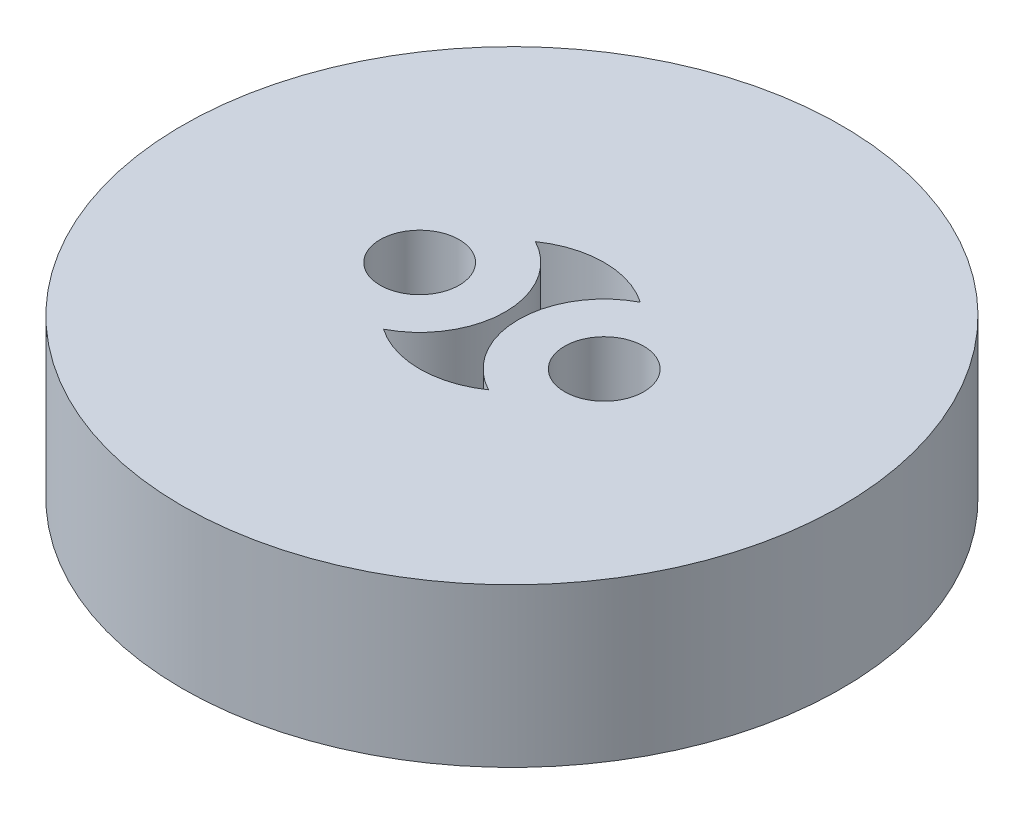
ISO-10303-21;
HEADER;
FILE_DESCRIPTION(('STEP AP214'),'2;1');
FILE_NAME('part.step','',(''),(''),'','','');
FILE_SCHEMA(('AUTOMOTIVE_DESIGN { 1 0 10303 214 1 1 1 1 }'));
ENDSEC;
DATA;
#1=APPLICATION_CONTEXT('core data for automotive mechanical design processes');
#2=APPLICATION_PROTOCOL_DEFINITION('international standard','automotive_design',2000,#1);
#3=PRODUCT_CONTEXT('',#1,'mechanical');
#4=PRODUCT('Part','Part','',(#3));
#5=PRODUCT_RELATED_PRODUCT_CATEGORY('part','',(#4));
#6=PRODUCT_DEFINITION_FORMATION('','',#4);
#7=PRODUCT_DEFINITION_CONTEXT('part definition',#1,'design');
#8=PRODUCT_DEFINITION('design','',#6,#7);
#9=PRODUCT_DEFINITION_SHAPE('','',#8);
#10=(LENGTH_UNIT() NAMED_UNIT(*) SI_UNIT(.MILLI.,.METRE.));
#11=(NAMED_UNIT(*) PLANE_ANGLE_UNIT() SI_UNIT($,.RADIAN.));
#12=(NAMED_UNIT(*) SI_UNIT($,.STERADIAN.) SOLID_ANGLE_UNIT());
#13=UNCERTAINTY_MEASURE_WITH_UNIT(LENGTH_MEASURE(1.E-05),#10,'distance_accuracy_value','');
#14=(GEOMETRIC_REPRESENTATION_CONTEXT(3) GLOBAL_UNCERTAINTY_ASSIGNED_CONTEXT((#13)) GLOBAL_UNIT_ASSIGNED_CONTEXT((#10,
#11,#12)) REPRESENTATION_CONTEXT('',''));
#15=CARTESIAN_POINT('',(0.,0.,0.));
#16=DIRECTION('',(0.,0.,1.));
#17=DIRECTION('',(1.,0.,0.));
#18=AXIS2_PLACEMENT_3D('',#15,#16,#17);
#19=CARTESIAN_POINT('',(0.,6.,0.));
#20=DIRECTION('',(0.,1.,0.));
#21=DIRECTION('',(0.,0.,1.));
#22=AXIS2_PLACEMENT_3D('',#19,#20,#21);
#23=PLANE('',#22);
#24=CARTESIAN_POINT('',(-3.5,6.,0.));
#25=DIRECTION('',(0.,1.,0.));
#26=DIRECTION('',(0.,0.,1.));
#27=AXIS2_PLACEMENT_3D('',#24,#25,#26);
#28=CIRCLE('',#27,1.5);
#29=CARTESIAN_POINT('',(-3.5,6.,1.5));
#30=VERTEX_POINT('',#29);
#31=EDGE_CURVE('E116',#30,#30,#28,.T.);
#32=ORIENTED_EDGE('',*,*,#31,.F.);
#33=EDGE_LOOP('',(#32));
#34=FACE_BOUND('',#33,.T.);
#35=CARTESIAN_POINT('',(0.,6.,0.));
#36=DIRECTION('',(0.,1.,0.));
#37=DIRECTION('',(0.,0.,1.));
#38=AXIS2_PLACEMENT_3D('',#35,#36,#37);
#39=CIRCLE('',#38,12.5);
#40=CARTESIAN_POINT('',(0.,6.,12.5));
#41=VERTEX_POINT('',#40);
#42=EDGE_CURVE('E11',#41,#41,#39,.T.);
#43=ORIENTED_EDGE('',*,*,#42,.T.);
#44=EDGE_LOOP('',(#43));
#45=FACE_BOUND('',#44,.T.);
#46=CARTESIAN_POINT('',(3.5,6.,0.));
#47=DIRECTION('',(0.,1.,0.));
#48=DIRECTION('',(0.,0.,1.));
#49=AXIS2_PLACEMENT_3D('',#46,#47,#48);
#50=CIRCLE('',#49,1.5);
#51=CARTESIAN_POINT('',(3.5,6.,1.5));
#52=VERTEX_POINT('',#51);
#53=EDGE_CURVE('E110',#52,#52,#50,.T.);
#54=ORIENTED_EDGE('',*,*,#53,.F.);
#55=EDGE_LOOP('',(#54));
#56=FACE_BOUND('',#55,.T.);
#57=CARTESIAN_POINT('',(-3.5,6.,0.));
#58=DIRECTION('',(0.,-1.,0.));
#59=DIRECTION('',(0.,0.,1.));
#60=AXIS2_PLACEMENT_3D('',#57,#58,#59);
#61=CIRCLE('',#60,3.25);
#62=CARTESIAN_POINT('',(-1.99107142857143,6.,-2.87847782105865));
#63=VERTEX_POINT('',#62);
#64=CARTESIAN_POINT('',(-1.99107142857143,6.,2.87847782105865));
#65=VERTEX_POINT('',#64);
#66=EDGE_CURVE('E82',#63,#65,#61,.T.);
#67=ORIENTED_EDGE('',*,*,#66,.F.);
#68=CARTESIAN_POINT('',(0.,6.,0.));
#69=DIRECTION('',(0.,1.,0.));
#70=DIRECTION('',(0.,0.,1.));
#71=AXIS2_PLACEMENT_3D('',#68,#69,#70);
#72=CIRCLE('',#71,3.5);
#73=CARTESIAN_POINT('',(1.99107142857143,6.,-2.87847782105865));
#74=VERTEX_POINT('',#73);
#75=EDGE_CURVE('E74',#74,#63,#72,.T.);
#76=ORIENTED_EDGE('',*,*,#75,.F.);
#77=CARTESIAN_POINT('',(3.5,6.,0.));
#78=DIRECTION('',(0.,-1.,0.));
#79=DIRECTION('',(0.,0.,1.));
#80=AXIS2_PLACEMENT_3D('',#77,#78,#79);
#81=CIRCLE('',#80,3.25);
#82=CARTESIAN_POINT('',(1.99107142857143,6.,2.87847782105865));
#83=VERTEX_POINT('',#82);
#84=EDGE_CURVE('E96',#83,#74,#81,.T.);
#85=ORIENTED_EDGE('',*,*,#84,.F.);
#86=CARTESIAN_POINT('',(0.,6.,0.));
#87=DIRECTION('',(0.,1.,0.));
#88=DIRECTION('',(0.,0.,1.));
#89=AXIS2_PLACEMENT_3D('',#86,#87,#88);
#90=CIRCLE('',#89,3.5);
#91=EDGE_CURVE('E94',#65,#83,#90,.T.);
#92=ORIENTED_EDGE('',*,*,#91,.F.);
#93=EDGE_LOOP('',(#67,#76,#85,#92));
#94=FACE_BOUND('',#93,.T.);
#95=ADVANCED_FACE('F33',(#34,#45,#56,#94),#23,.T.);
#96=CARTESIAN_POINT('',(0.,0.,0.));
#97=DIRECTION('',(0.,1.,0.));
#98=DIRECTION('',(0.,0.,1.));
#99=AXIS2_PLACEMENT_3D('',#96,#97,#98);
#100=PLANE('',#99);
#101=CARTESIAN_POINT('',(3.5,0.,0.));
#102=DIRECTION('',(0.,1.,0.));
#103=DIRECTION('',(0.,0.,1.));
#104=AXIS2_PLACEMENT_3D('',#101,#102,#103);
#105=CIRCLE('',#104,1.5);
#106=CARTESIAN_POINT('',(3.5,0.,1.5));
#107=VERTEX_POINT('',#106);
#108=EDGE_CURVE('E90',#107,#107,#105,.T.);
#109=ORIENTED_EDGE('',*,*,#108,.T.);
#110=EDGE_LOOP('',(#109));
#111=FACE_BOUND('',#110,.T.);
#112=CARTESIAN_POINT('',(-3.5,0.,0.));
#113=DIRECTION('',(0.,1.,0.));
#114=DIRECTION('',(0.,0.,1.));
#115=AXIS2_PLACEMENT_3D('',#112,#113,#114);
#116=CIRCLE('',#115,1.5);
#117=CARTESIAN_POINT('',(-3.5,0.,1.5));
#118=VERTEX_POINT('',#117);
#119=EDGE_CURVE('E113',#118,#118,#116,.T.);
#120=ORIENTED_EDGE('',*,*,#119,.T.);
#121=EDGE_LOOP('',(#120));
#122=FACE_BOUND('',#121,.T.);
#123=CARTESIAN_POINT('',(0.,0.,0.));
#124=DIRECTION('',(0.,1.,0.));
#125=DIRECTION('',(0.,0.,1.));
#126=AXIS2_PLACEMENT_3D('',#123,#124,#125);
#127=CIRCLE('',#126,12.5);
#128=CARTESIAN_POINT('',(0.,0.,12.5));
#129=VERTEX_POINT('',#128);
#130=EDGE_CURVE('E37',#129,#129,#127,.T.);
#131=ORIENTED_EDGE('',*,*,#130,.F.);
#132=EDGE_LOOP('',(#131));
#133=FACE_BOUND('',#132,.T.);
#134=CARTESIAN_POINT('',(0.,0.,0.));
#135=DIRECTION('',(0.,1.,0.));
#136=DIRECTION('',(0.,0.,1.));
#137=AXIS2_PLACEMENT_3D('',#134,#135,#136);
#138=CIRCLE('',#137,3.5);
#139=CARTESIAN_POINT('',(1.99107142857143,0.,-2.87847782105865));
#140=VERTEX_POINT('',#139);
#141=CARTESIAN_POINT('',(-1.99107142857143,0.,-2.87847782105865));
#142=VERTEX_POINT('',#141);
#143=EDGE_CURVE('E56',#140,#142,#138,.T.);
#144=ORIENTED_EDGE('',*,*,#143,.T.);
#145=CARTESIAN_POINT('',(-3.5,0.,0.));
#146=DIRECTION('',(0.,-1.,0.));
#147=DIRECTION('',(0.,0.,1.));
#148=AXIS2_PLACEMENT_3D('',#145,#146,#147);
#149=CIRCLE('',#148,3.25);
#150=CARTESIAN_POINT('',(-1.99107142857143,0.,2.87847782105865));
#151=VERTEX_POINT('',#150);
#152=EDGE_CURVE('E89',#142,#151,#149,.T.);
#153=ORIENTED_EDGE('',*,*,#152,.T.);
#154=CARTESIAN_POINT('',(0.,0.,0.));
#155=DIRECTION('',(0.,1.,0.));
#156=DIRECTION('',(0.,0.,1.));
#157=AXIS2_PLACEMENT_3D('',#154,#155,#156);
#158=CIRCLE('',#157,3.5);
#159=CARTESIAN_POINT('',(1.99107142857143,0.,2.87847782105865));
#160=VERTEX_POINT('',#159);
#161=EDGE_CURVE('E102',#151,#160,#158,.T.);
#162=ORIENTED_EDGE('',*,*,#161,.T.);
#163=CARTESIAN_POINT('',(3.5,0.,0.));
#164=DIRECTION('',(0.,-1.,0.));
#165=DIRECTION('',(0.,0.,1.));
#166=AXIS2_PLACEMENT_3D('',#163,#164,#165);
#167=CIRCLE('',#166,3.25);
#168=EDGE_CURVE('E83',#160,#140,#167,.T.);
#169=ORIENTED_EDGE('',*,*,#168,.T.);
#170=EDGE_LOOP('',(#144,#153,#162,#169));
#171=FACE_BOUND('',#170,.T.);
#172=ADVANCED_FACE('F122',(#111,#122,#133,#171),#100,.F.);
#173=CARTESIAN_POINT('',(0.,6.,0.));
#174=DIRECTION('',(0.,-1.,0.));
#175=DIRECTION('',(0.,0.,-1.));
#176=AXIS2_PLACEMENT_3D('',#173,#174,#175);
#177=CYLINDRICAL_SURFACE('',#176,12.5);
#178=ORIENTED_EDGE('',*,*,#42,.F.);
#179=EDGE_LOOP('',(#178));
#180=FACE_BOUND('',#179,.T.);
#181=ORIENTED_EDGE('',*,*,#130,.T.);
#182=EDGE_LOOP('',(#181));
#183=FACE_BOUND('',#182,.T.);
#184=ADVANCED_FACE('F35',(#180,#183),#177,.T.);
#185=CARTESIAN_POINT('',(-3.5,6.,0.));
#186=DIRECTION('',(0.,-1.,0.));
#187=DIRECTION('',(0.,0.,-1.));
#188=AXIS2_PLACEMENT_3D('',#185,#186,#187);
#189=CYLINDRICAL_SURFACE('',#188,1.5);
#190=ORIENTED_EDGE('',*,*,#31,.T.);
#191=EDGE_LOOP('',(#190));
#192=FACE_BOUND('',#191,.T.);
#193=ORIENTED_EDGE('',*,*,#119,.F.);
#194=EDGE_LOOP('',(#193));
#195=FACE_BOUND('',#194,.T.);
#196=ADVANCED_FACE('F125',(#192,#195),#189,.F.);
#197=CARTESIAN_POINT('',(3.5,6.,0.));
#198=DIRECTION('',(0.,-1.,0.));
#199=DIRECTION('',(0.,0.,-1.));
#200=AXIS2_PLACEMENT_3D('',#197,#198,#199);
#201=CYLINDRICAL_SURFACE('',#200,1.5);
#202=ORIENTED_EDGE('',*,*,#53,.T.);
#203=EDGE_LOOP('',(#202));
#204=FACE_BOUND('',#203,.T.);
#205=ORIENTED_EDGE('',*,*,#108,.F.);
#206=EDGE_LOOP('',(#205));
#207=FACE_BOUND('',#206,.T.);
#208=ADVANCED_FACE('F127',(#204,#207),#201,.F.);
#209=CARTESIAN_POINT('',(0.,6.,0.));
#210=DIRECTION('',(0.,-1.,0.));
#211=DIRECTION('',(0.,0.,-1.));
#212=AXIS2_PLACEMENT_3D('',#209,#210,#211);
#213=CYLINDRICAL_SURFACE('',#212,3.5);
#214=ORIENTED_EDGE('',*,*,#143,.F.);
#215=DIRECTION('',(0.,-1.,0.));
#216=VECTOR('',#215,1.);
#217=CARTESIAN_POINT('',(1.99107142857143,6.,-2.87847782105865));
#218=LINE('',#217,#216);
#219=EDGE_CURVE('E78',#74,#140,#218,.T.);
#220=ORIENTED_EDGE('',*,*,#219,.F.);
#221=ORIENTED_EDGE('',*,*,#75,.T.);
#222=DIRECTION('',(0.,-1.,0.));
#223=VECTOR('',#222,1.);
#224=CARTESIAN_POINT('',(-1.99107142857143,6.,-2.87847782105865));
#225=LINE('',#224,#223);
#226=EDGE_CURVE('E77',#63,#142,#225,.T.);
#227=ORIENTED_EDGE('',*,*,#226,.T.);
#228=EDGE_LOOP('',(#214,#220,#221,#227));
#229=FACE_BOUND('',#228,.T.);
#230=ADVANCED_FACE('F76',(#229),#213,.F.);
#231=CARTESIAN_POINT('',(-3.5,6.,0.));
#232=DIRECTION('',(0.,-1.,0.));
#233=DIRECTION('',(0.,0.,-1.));
#234=AXIS2_PLACEMENT_3D('',#231,#232,#233);
#235=CYLINDRICAL_SURFACE('',#234,3.25);
#236=ORIENTED_EDGE('',*,*,#152,.F.);
#237=ORIENTED_EDGE('',*,*,#226,.F.);
#238=ORIENTED_EDGE('',*,*,#66,.T.);
#239=DIRECTION('',(0.,-1.,0.));
#240=VECTOR('',#239,1.);
#241=CARTESIAN_POINT('',(-1.99107142857143,6.,2.87847782105865));
#242=LINE('',#241,#240);
#243=EDGE_CURVE('E91',#65,#151,#242,.T.);
#244=ORIENTED_EDGE('',*,*,#243,.T.);
#245=EDGE_LOOP('',(#236,#237,#238,#244));
#246=FACE_BOUND('',#245,.T.);
#247=ADVANCED_FACE('F86',(#246),#235,.T.);
#248=CARTESIAN_POINT('',(0.,6.,0.));
#249=DIRECTION('',(0.,-1.,0.));
#250=DIRECTION('',(0.,0.,-1.));
#251=AXIS2_PLACEMENT_3D('',#248,#249,#250);
#252=CYLINDRICAL_SURFACE('',#251,3.5);
#253=ORIENTED_EDGE('',*,*,#161,.F.);
#254=ORIENTED_EDGE('',*,*,#243,.F.);
#255=ORIENTED_EDGE('',*,*,#91,.T.);
#256=DIRECTION('',(0.,-1.,0.));
#257=VECTOR('',#256,1.);
#258=CARTESIAN_POINT('',(1.99107142857143,6.,2.87847782105865));
#259=LINE('',#258,#257);
#260=EDGE_CURVE('E48',#83,#160,#259,.T.);
#261=ORIENTED_EDGE('',*,*,#260,.T.);
#262=EDGE_LOOP('',(#253,#254,#255,#261));
#263=FACE_BOUND('',#262,.T.);
#264=ADVANCED_FACE('F158',(#263),#252,.F.);
#265=CARTESIAN_POINT('',(3.5,6.,0.));
#266=DIRECTION('',(0.,-1.,0.));
#267=DIRECTION('',(0.,0.,-1.));
#268=AXIS2_PLACEMENT_3D('',#265,#266,#267);
#269=CYLINDRICAL_SURFACE('',#268,3.25);
#270=ORIENTED_EDGE('',*,*,#168,.F.);
#271=ORIENTED_EDGE('',*,*,#260,.F.);
#272=ORIENTED_EDGE('',*,*,#84,.T.);
#273=ORIENTED_EDGE('',*,*,#219,.T.);
#274=EDGE_LOOP('',(#270,#271,#272,#273));
#275=FACE_BOUND('',#274,.T.);
#276=ADVANCED_FACE('F156',(#275),#269,.T.);
#277=CLOSED_SHELL('',(#95,#172,#184,#196,#208,#230,#247,#264,#276));
#278=MANIFOLD_SOLID_BREP('B2',#277);
#279=ADVANCED_BREP_SHAPE_REPRESENTATION('',(#18,#278),#14);
#280=SHAPE_DEFINITION_REPRESENTATION(#9,#279);
ENDSEC;
END-ISO-10303-21;
